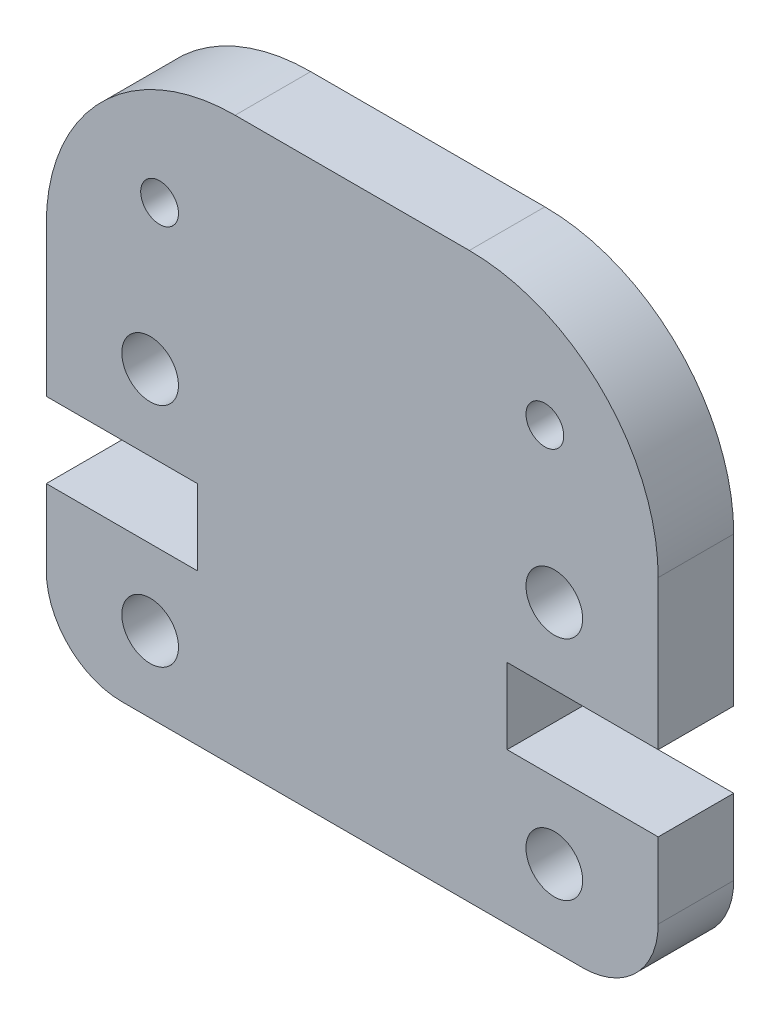
ISO-10303-21;
HEADER;
FILE_DESCRIPTION(('STEP AP214'),'2;1');
FILE_NAME('part.step','',(''),(''),'','','');
FILE_SCHEMA(('AUTOMOTIVE_DESIGN { 1 0 10303 214 1 1 1 1 }'));
ENDSEC;
DATA;
#1=APPLICATION_CONTEXT('core data for automotive mechanical design processes');
#2=APPLICATION_PROTOCOL_DEFINITION('international standard','automotive_design',2000,#1);
#3=PRODUCT_CONTEXT('',#1,'mechanical');
#4=PRODUCT('Part','Part','',(#3));
#5=PRODUCT_RELATED_PRODUCT_CATEGORY('part','',(#4));
#6=PRODUCT_DEFINITION_FORMATION('','',#4);
#7=PRODUCT_DEFINITION_CONTEXT('part definition',#1,'design');
#8=PRODUCT_DEFINITION('design','',#6,#7);
#9=PRODUCT_DEFINITION_SHAPE('','',#8);
#10=(LENGTH_UNIT() NAMED_UNIT(*) SI_UNIT(.MILLI.,.METRE.));
#11=(NAMED_UNIT(*) PLANE_ANGLE_UNIT() SI_UNIT($,.RADIAN.));
#12=(NAMED_UNIT(*) SI_UNIT($,.STERADIAN.) SOLID_ANGLE_UNIT());
#13=UNCERTAINTY_MEASURE_WITH_UNIT(LENGTH_MEASURE(1.E-05),#10,'distance_accuracy_value','');
#14=(GEOMETRIC_REPRESENTATION_CONTEXT(3) GLOBAL_UNCERTAINTY_ASSIGNED_CONTEXT((#13)) GLOBAL_UNIT_ASSIGNED_CONTEXT((#10,
#11,#12)) REPRESENTATION_CONTEXT('',''));
#15=CARTESIAN_POINT('',(0.,0.,0.));
#16=DIRECTION('',(0.,0.,1.));
#17=DIRECTION('',(1.,0.,0.));
#18=AXIS2_PLACEMENT_3D('',#15,#16,#17);
#19=CARTESIAN_POINT('',(14.2,2.,2.));
#20=DIRECTION('',(0.,0.,-1.));
#21=DIRECTION('',(-1.,0.,0.));
#22=AXIS2_PLACEMENT_3D('',#19,#20,#21);
#23=PLANE('',#22);
#24=CARTESIAN_POINT('',(2.75000000000306,2.,2.));
#25=DIRECTION('',(0.,0.,1.));
#26=DIRECTION('',(1.,0.,0.));
#27=AXIS2_PLACEMENT_3D('',#24,#25,#26);
#28=CIRCLE('',#27,0.750000000000133);
#29=CARTESIAN_POINT('',(3.50000000000319,2.,2.));
#30=VERTEX_POINT('',#29);
#31=EDGE_CURVE('E352',#30,#30,#28,.T.);
#32=ORIENTED_EDGE('',*,*,#31,.F.);
#33=EDGE_LOOP('',(#32));
#34=FACE_BOUND('',#33,.T.);
#35=CARTESIAN_POINT('',(13.1999999999968,11.942,2.));
#36=DIRECTION('',(0.,0.,1.));
#37=DIRECTION('',(-1.,0.,0.));
#38=AXIS2_PLACEMENT_3D('',#35,#36,#37);
#39=CIRCLE('',#38,0.499999999999945);
#40=CARTESIAN_POINT('',(12.6999999999968,11.942,2.));
#41=VERTEX_POINT('',#40);
#42=EDGE_CURVE('E364',#41,#41,#39,.T.);
#43=ORIENTED_EDGE('',*,*,#42,.F.);
#44=EDGE_LOOP('',(#43));
#45=FACE_BOUND('',#44,.T.);
#46=CARTESIAN_POINT('',(13.4499999999969,8.,2.));
#47=DIRECTION('',(0.,0.,1.));
#48=DIRECTION('',(1.,0.,0.));
#49=AXIS2_PLACEMENT_3D('',#46,#47,#48);
#50=CIRCLE('',#49,0.750000000003057);
#51=CARTESIAN_POINT('',(14.2,8.,2.));
#52=VERTEX_POINT('',#51);
#53=EDGE_CURVE('E182',#52,#52,#50,.T.);
#54=ORIENTED_EDGE('',*,*,#53,.F.);
#55=EDGE_LOOP('',(#54));
#56=FACE_BOUND('',#55,.T.);
#57=CARTESIAN_POINT('',(14.2,2.,2.));
#58=DIRECTION('',(0.,0.,1.));
#59=DIRECTION('',(-1.,0.,0.));
#60=AXIS2_PLACEMENT_3D('',#57,#58,#59);
#61=CIRCLE('',#60,2.);
#62=CARTESIAN_POINT('',(14.2,0.,2.));
#63=VERTEX_POINT('',#62);
#64=CARTESIAN_POINT('',(16.2,2.,2.));
#65=VERTEX_POINT('',#64);
#66=EDGE_CURVE('E209',#63,#65,#61,.T.);
#67=ORIENTED_EDGE('',*,*,#66,.T.);
#68=DIRECTION('',(0.,1.,0.));
#69=VECTOR('',#68,1.);
#70=CARTESIAN_POINT('',(16.2,2.,2.));
#71=LINE('',#70,#69);
#72=CARTESIAN_POINT('',(16.2,4.,2.));
#73=VERTEX_POINT('',#72);
#74=EDGE_CURVE('E117',#65,#73,#71,.T.);
#75=ORIENTED_EDGE('',*,*,#74,.T.);
#76=DIRECTION('',(-1.,0.,0.));
#77=VECTOR('',#76,1.);
#78=CARTESIAN_POINT('',(12.2,4.,2.));
#79=LINE('',#78,#77);
#80=CARTESIAN_POINT('',(12.2,4.,2.));
#81=VERTEX_POINT('',#80);
#82=EDGE_CURVE('E248',#73,#81,#79,.T.);
#83=ORIENTED_EDGE('',*,*,#82,.T.);
#84=DIRECTION('',(0.,1.,0.));
#85=VECTOR('',#84,1.);
#86=CARTESIAN_POINT('',(12.2,6.,2.));
#87=LINE('',#86,#85);
#88=CARTESIAN_POINT('',(12.2,6.,2.));
#89=VERTEX_POINT('',#88);
#90=EDGE_CURVE('E267',#81,#89,#87,.T.);
#91=ORIENTED_EDGE('',*,*,#90,.T.);
#92=DIRECTION('',(1.,0.,0.));
#93=VECTOR('',#92,1.);
#94=CARTESIAN_POINT('',(16.2,6.00000000000001,2.));
#95=LINE('',#94,#93);
#96=CARTESIAN_POINT('',(16.2,6.00000000000001,2.));
#97=VERTEX_POINT('',#96);
#98=EDGE_CURVE('E264',#89,#97,#95,.T.);
#99=ORIENTED_EDGE('',*,*,#98,.T.);
#100=DIRECTION('',(0.,1.,0.));
#101=VECTOR('',#100,1.);
#102=CARTESIAN_POINT('',(16.2,9.945,2.));
#103=LINE('',#102,#101);
#104=CARTESIAN_POINT('',(16.2,9.945,2.));
#105=VERTEX_POINT('',#104);
#106=EDGE_CURVE('E266',#97,#105,#103,.T.);
#107=ORIENTED_EDGE('',*,*,#106,.T.);
#108=CARTESIAN_POINT('',(11.2,9.94499999999999,2.));
#109=DIRECTION('',(0.,0.,1.));
#110=DIRECTION('',(-1.,0.,0.));
#111=AXIS2_PLACEMENT_3D('',#108,#109,#110);
#112=CIRCLE('',#111,5.);
#113=CARTESIAN_POINT('',(11.2,14.945,2.));
#114=VERTEX_POINT('',#113);
#115=EDGE_CURVE('E269',#105,#114,#112,.T.);
#116=ORIENTED_EDGE('',*,*,#115,.T.);
#117=DIRECTION('',(-1.,0.,0.));
#118=VECTOR('',#117,1.);
#119=CARTESIAN_POINT('',(5.,14.945,2.));
#120=LINE('',#119,#118);
#121=CARTESIAN_POINT('',(5.,14.945,2.));
#122=VERTEX_POINT('',#121);
#123=EDGE_CURVE('E275',#114,#122,#120,.T.);
#124=ORIENTED_EDGE('',*,*,#123,.T.);
#125=CARTESIAN_POINT('',(5.,9.94499999999999,2.));
#126=DIRECTION('',(0.,0.,1.));
#127=DIRECTION('',(1.,0.,0.));
#128=AXIS2_PLACEMENT_3D('',#125,#126,#127);
#129=CIRCLE('',#128,5.);
#130=CARTESIAN_POINT('',(0.,9.94499999999999,2.));
#131=VERTEX_POINT('',#130);
#132=EDGE_CURVE('E277',#122,#131,#129,.T.);
#133=ORIENTED_EDGE('',*,*,#132,.T.);
#134=DIRECTION('',(0.,-1.,0.));
#135=VECTOR('',#134,1.);
#136=CARTESIAN_POINT('',(0.,9.94499999999999,2.));
#137=LINE('',#136,#135);
#138=CARTESIAN_POINT('',(0.,6.00000000000001,2.));
#139=VERTEX_POINT('',#138);
#140=EDGE_CURVE('E279',#131,#139,#137,.T.);
#141=ORIENTED_EDGE('',*,*,#140,.T.);
#142=DIRECTION('',(1.,0.,0.));
#143=VECTOR('',#142,1.);
#144=CARTESIAN_POINT('',(0.,6.00000000000001,2.));
#145=LINE('',#144,#143);
#146=CARTESIAN_POINT('',(4.,6.00000000000001,2.));
#147=VERTEX_POINT('',#146);
#148=EDGE_CURVE('E281',#139,#147,#145,.T.);
#149=ORIENTED_EDGE('',*,*,#148,.T.);
#150=DIRECTION('',(0.,-1.,0.));
#151=VECTOR('',#150,1.);
#152=CARTESIAN_POINT('',(4.,6.00000000000001,2.));
#153=LINE('',#152,#151);
#154=CARTESIAN_POINT('',(4.,4.,2.));
#155=VERTEX_POINT('',#154);
#156=EDGE_CURVE('E283',#147,#155,#153,.T.);
#157=ORIENTED_EDGE('',*,*,#156,.T.);
#158=DIRECTION('',(-1.,0.,0.));
#159=VECTOR('',#158,1.);
#160=CARTESIAN_POINT('',(4.,4.,2.));
#161=LINE('',#160,#159);
#162=CARTESIAN_POINT('',(0.,4.,2.));
#163=VERTEX_POINT('',#162);
#164=EDGE_CURVE('E160',#155,#163,#161,.T.);
#165=ORIENTED_EDGE('',*,*,#164,.T.);
#166=DIRECTION('',(0.,-1.,0.));
#167=VECTOR('',#166,1.);
#168=CARTESIAN_POINT('',(0.,2.,2.));
#169=LINE('',#168,#167);
#170=CARTESIAN_POINT('',(0.,2.,2.));
#171=VERTEX_POINT('',#170);
#172=EDGE_CURVE('E154',#163,#171,#169,.T.);
#173=ORIENTED_EDGE('',*,*,#172,.T.);
#174=CARTESIAN_POINT('',(2.,2.,2.));
#175=DIRECTION('',(0.,0.,1.));
#176=DIRECTION('',(1.,0.,0.));
#177=AXIS2_PLACEMENT_3D('',#174,#175,#176);
#178=CIRCLE('',#177,2.);
#179=CARTESIAN_POINT('',(2.,0.,2.));
#180=VERTEX_POINT('',#179);
#181=EDGE_CURVE('E158',#171,#180,#178,.T.);
#182=ORIENTED_EDGE('',*,*,#181,.T.);
#183=DIRECTION('',(1.,0.,0.));
#184=VECTOR('',#183,1.);
#185=CARTESIAN_POINT('',(2.,0.,2.));
#186=LINE('',#185,#184);
#187=EDGE_CURVE('E50',#180,#63,#186,.T.);
#188=ORIENTED_EDGE('',*,*,#187,.T.);
#189=EDGE_LOOP('',(#67,#75,#83,#91,#99,#107,#116,#124,#133,#141,#149,#157,#165,#173,#182,#188));
#190=FACE_BOUND('',#189,.T.);
#191=CARTESIAN_POINT('',(13.4499999999969,2.,2.));
#192=DIRECTION('',(0.,0.,1.));
#193=DIRECTION('',(-1.,0.,0.));
#194=AXIS2_PLACEMENT_3D('',#191,#192,#193);
#195=CIRCLE('',#194,0.750000000003057);
#196=CARTESIAN_POINT('',(12.6999999999939,2.,2.));
#197=VERTEX_POINT('',#196);
#198=EDGE_CURVE('E370',#197,#197,#195,.T.);
#199=ORIENTED_EDGE('',*,*,#198,.F.);
#200=EDGE_LOOP('',(#199));
#201=FACE_BOUND('',#200,.T.);
#202=CARTESIAN_POINT('',(3.00000000000321,11.942,2.));
#203=DIRECTION('',(0.,0.,1.));
#204=DIRECTION('',(1.,0.,0.));
#205=AXIS2_PLACEMENT_3D('',#202,#203,#204);
#206=CIRCLE('',#205,0.499999999999944);
#207=CARTESIAN_POINT('',(3.50000000000316,11.942,2.));
#208=VERTEX_POINT('',#207);
#209=EDGE_CURVE('E358',#208,#208,#206,.T.);
#210=ORIENTED_EDGE('',*,*,#209,.F.);
#211=EDGE_LOOP('',(#210));
#212=FACE_BOUND('',#211,.T.);
#213=CARTESIAN_POINT('',(2.75000000000306,8.,2.));
#214=DIRECTION('',(0.,0.,1.));
#215=DIRECTION('',(-1.,0.,0.));
#216=AXIS2_PLACEMENT_3D('',#213,#214,#215);
#217=CIRCLE('',#216,0.750000000003058);
#218=CARTESIAN_POINT('',(2.,8.,2.));
#219=VERTEX_POINT('',#218);
#220=EDGE_CURVE('E343',#219,#219,#217,.T.);
#221=ORIENTED_EDGE('',*,*,#220,.F.);
#222=EDGE_LOOP('',(#221));
#223=FACE_BOUND('',#222,.T.);
#224=ADVANCED_FACE('F33',(#34,#45,#56,#190,#201,#212,#223),#23,.F.);
#225=CARTESIAN_POINT('',(14.2,2.,0.));
#226=DIRECTION('',(0.,0.,-1.));
#227=DIRECTION('',(-1.,0.,0.));
#228=AXIS2_PLACEMENT_3D('',#225,#226,#227);
#229=PLANE('',#228);
#230=CARTESIAN_POINT('',(2.75000000000306,2.,0.));
#231=DIRECTION('',(0.,0.,1.));
#232=DIRECTION('',(1.,0.,0.));
#233=AXIS2_PLACEMENT_3D('',#230,#231,#232);
#234=CIRCLE('',#233,0.750000000000133);
#235=CARTESIAN_POINT('',(3.50000000000319,2.,0.));
#236=VERTEX_POINT('',#235);
#237=EDGE_CURVE('E349',#236,#236,#234,.T.);
#238=ORIENTED_EDGE('',*,*,#237,.T.);
#239=EDGE_LOOP('',(#238));
#240=FACE_BOUND('',#239,.T.);
#241=CARTESIAN_POINT('',(13.1999999999968,11.942,0.));
#242=DIRECTION('',(0.,0.,1.));
#243=DIRECTION('',(-1.,0.,0.));
#244=AXIS2_PLACEMENT_3D('',#241,#242,#243);
#245=CIRCLE('',#244,0.499999999999945);
#246=CARTESIAN_POINT('',(12.6999999999968,11.942,0.));
#247=VERTEX_POINT('',#246);
#248=EDGE_CURVE('E361',#247,#247,#245,.T.);
#249=ORIENTED_EDGE('',*,*,#248,.T.);
#250=EDGE_LOOP('',(#249));
#251=FACE_BOUND('',#250,.T.);
#252=CARTESIAN_POINT('',(13.4499999999969,8.,0.));
#253=DIRECTION('',(0.,0.,1.));
#254=DIRECTION('',(1.,0.,0.));
#255=AXIS2_PLACEMENT_3D('',#252,#253,#254);
#256=CIRCLE('',#255,0.750000000003057);
#257=CARTESIAN_POINT('',(14.2,8.,0.));
#258=VERTEX_POINT('',#257);
#259=EDGE_CURVE('E373',#258,#258,#256,.T.);
#260=ORIENTED_EDGE('',*,*,#259,.T.);
#261=EDGE_LOOP('',(#260));
#262=FACE_BOUND('',#261,.T.);
#263=CARTESIAN_POINT('',(14.2,2.,0.));
#264=DIRECTION('',(0.,0.,1.));
#265=DIRECTION('',(-1.,0.,0.));
#266=AXIS2_PLACEMENT_3D('',#263,#264,#265);
#267=CIRCLE('',#266,2.);
#268=CARTESIAN_POINT('',(14.2,0.,0.));
#269=VERTEX_POINT('',#268);
#270=CARTESIAN_POINT('',(16.2,2.,0.));
#271=VERTEX_POINT('',#270);
#272=EDGE_CURVE('E178',#269,#271,#267,.T.);
#273=ORIENTED_EDGE('',*,*,#272,.F.);
#274=DIRECTION('',(1.,0.,0.));
#275=VECTOR('',#274,1.);
#276=CARTESIAN_POINT('',(2.,0.,0.));
#277=LINE('',#276,#275);
#278=CARTESIAN_POINT('',(2.,0.,0.));
#279=VERTEX_POINT('',#278);
#280=EDGE_CURVE('E109',#279,#269,#277,.T.);
#281=ORIENTED_EDGE('',*,*,#280,.F.);
#282=CARTESIAN_POINT('',(2.,2.,0.));
#283=DIRECTION('',(0.,0.,1.));
#284=DIRECTION('',(1.,0.,0.));
#285=AXIS2_PLACEMENT_3D('',#282,#283,#284);
#286=CIRCLE('',#285,2.);
#287=CARTESIAN_POINT('',(0.,2.,0.));
#288=VERTEX_POINT('',#287);
#289=EDGE_CURVE('E103',#288,#279,#286,.T.);
#290=ORIENTED_EDGE('',*,*,#289,.F.);
#291=DIRECTION('',(0.,-1.,0.));
#292=VECTOR('',#291,1.);
#293=CARTESIAN_POINT('',(0.,2.,0.));
#294=LINE('',#293,#292);
#295=CARTESIAN_POINT('',(0.,4.,0.));
#296=VERTEX_POINT('',#295);
#297=EDGE_CURVE('E168',#296,#288,#294,.T.);
#298=ORIENTED_EDGE('',*,*,#297,.F.);
#299=DIRECTION('',(-1.,0.,0.));
#300=VECTOR('',#299,1.);
#301=CARTESIAN_POINT('',(4.,4.,0.));
#302=LINE('',#301,#300);
#303=CARTESIAN_POINT('',(4.,4.,0.));
#304=VERTEX_POINT('',#303);
#305=EDGE_CURVE('E204',#304,#296,#302,.T.);
#306=ORIENTED_EDGE('',*,*,#305,.F.);
#307=DIRECTION('',(0.,-1.,0.));
#308=VECTOR('',#307,1.);
#309=CARTESIAN_POINT('',(4.,6.00000000000001,0.));
#310=LINE('',#309,#308);
#311=CARTESIAN_POINT('',(4.,6.00000000000001,0.));
#312=VERTEX_POINT('',#311);
#313=EDGE_CURVE('E202',#312,#304,#310,.T.);
#314=ORIENTED_EDGE('',*,*,#313,.F.);
#315=DIRECTION('',(1.,0.,0.));
#316=VECTOR('',#315,1.);
#317=CARTESIAN_POINT('',(0.,6.00000000000001,0.));
#318=LINE('',#317,#316);
#319=CARTESIAN_POINT('',(0.,6.00000000000001,0.));
#320=VERTEX_POINT('',#319);
#321=EDGE_CURVE('E200',#320,#312,#318,.T.);
#322=ORIENTED_EDGE('',*,*,#321,.F.);
#323=DIRECTION('',(0.,-1.,0.));
#324=VECTOR('',#323,1.);
#325=CARTESIAN_POINT('',(0.,9.94499999999999,0.));
#326=LINE('',#325,#324);
#327=CARTESIAN_POINT('',(0.,9.94499999999999,0.));
#328=VERTEX_POINT('',#327);
#329=EDGE_CURVE('E198',#328,#320,#326,.T.);
#330=ORIENTED_EDGE('',*,*,#329,.F.);
#331=CARTESIAN_POINT('',(5.,9.94499999999999,0.));
#332=DIRECTION('',(0.,0.,1.));
#333=DIRECTION('',(1.,0.,0.));
#334=AXIS2_PLACEMENT_3D('',#331,#332,#333);
#335=CIRCLE('',#334,5.);
#336=CARTESIAN_POINT('',(5.,14.945,0.));
#337=VERTEX_POINT('',#336);
#338=EDGE_CURVE('E196',#337,#328,#335,.T.);
#339=ORIENTED_EDGE('',*,*,#338,.F.);
#340=DIRECTION('',(-1.,0.,0.));
#341=VECTOR('',#340,1.);
#342=CARTESIAN_POINT('',(5.,14.945,0.));
#343=LINE('',#342,#341);
#344=CARTESIAN_POINT('',(11.2,14.945,0.));
#345=VERTEX_POINT('',#344);
#346=EDGE_CURVE('E194',#345,#337,#343,.T.);
#347=ORIENTED_EDGE('',*,*,#346,.F.);
#348=CARTESIAN_POINT('',(11.2,9.94499999999999,0.));
#349=DIRECTION('',(0.,0.,1.));
#350=DIRECTION('',(-1.,0.,0.));
#351=AXIS2_PLACEMENT_3D('',#348,#349,#350);
#352=CIRCLE('',#351,5.);
#353=CARTESIAN_POINT('',(16.2,9.945,0.));
#354=VERTEX_POINT('',#353);
#355=EDGE_CURVE('E192',#354,#345,#352,.T.);
#356=ORIENTED_EDGE('',*,*,#355,.F.);
#357=DIRECTION('',(0.,1.,0.));
#358=VECTOR('',#357,1.);
#359=CARTESIAN_POINT('',(16.2,9.945,0.));
#360=LINE('',#359,#358);
#361=CARTESIAN_POINT('',(16.2,6.00000000000001,0.));
#362=VERTEX_POINT('',#361);
#363=EDGE_CURVE('E190',#362,#354,#360,.T.);
#364=ORIENTED_EDGE('',*,*,#363,.F.);
#365=DIRECTION('',(1.,0.,0.));
#366=VECTOR('',#365,1.);
#367=CARTESIAN_POINT('',(16.2,6.00000000000001,0.));
#368=LINE('',#367,#366);
#369=CARTESIAN_POINT('',(12.2,6.,0.));
#370=VERTEX_POINT('',#369);
#371=EDGE_CURVE('E188',#370,#362,#368,.T.);
#372=ORIENTED_EDGE('',*,*,#371,.F.);
#373=DIRECTION('',(0.,1.,0.));
#374=VECTOR('',#373,1.);
#375=CARTESIAN_POINT('',(12.2,6.,0.));
#376=LINE('',#375,#374);
#377=CARTESIAN_POINT('',(12.2,4.,0.));
#378=VERTEX_POINT('',#377);
#379=EDGE_CURVE('E186',#378,#370,#376,.T.);
#380=ORIENTED_EDGE('',*,*,#379,.F.);
#381=DIRECTION('',(-1.,0.,0.));
#382=VECTOR('',#381,1.);
#383=CARTESIAN_POINT('',(12.2,4.,0.));
#384=LINE('',#383,#382);
#385=CARTESIAN_POINT('',(16.2,4.,0.));
#386=VERTEX_POINT('',#385);
#387=EDGE_CURVE('E184',#386,#378,#384,.T.);
#388=ORIENTED_EDGE('',*,*,#387,.F.);
#389=DIRECTION('',(0.,1.,0.));
#390=VECTOR('',#389,1.);
#391=CARTESIAN_POINT('',(16.2,2.,0.));
#392=LINE('',#391,#390);
#393=EDGE_CURVE('E181',#271,#386,#392,.T.);
#394=ORIENTED_EDGE('',*,*,#393,.F.);
#395=EDGE_LOOP('',(#273,#281,#290,#298,#306,#314,#322,#330,#339,#347,#356,#364,#372,#380,#388,#394));
#396=FACE_BOUND('',#395,.T.);
#397=CARTESIAN_POINT('',(13.4499999999969,2.,0.));
#398=DIRECTION('',(0.,0.,1.));
#399=DIRECTION('',(-1.,0.,0.));
#400=AXIS2_PLACEMENT_3D('',#397,#398,#399);
#401=CIRCLE('',#400,0.750000000003057);
#402=CARTESIAN_POINT('',(12.6999999999939,2.,0.));
#403=VERTEX_POINT('',#402);
#404=EDGE_CURVE('E367',#403,#403,#401,.T.);
#405=ORIENTED_EDGE('',*,*,#404,.T.);
#406=EDGE_LOOP('',(#405));
#407=FACE_BOUND('',#406,.T.);
#408=CARTESIAN_POINT('',(3.00000000000321,11.942,0.));
#409=DIRECTION('',(0.,0.,1.));
#410=DIRECTION('',(1.,0.,0.));
#411=AXIS2_PLACEMENT_3D('',#408,#409,#410);
#412=CIRCLE('',#411,0.499999999999944);
#413=CARTESIAN_POINT('',(3.50000000000316,11.942,0.));
#414=VERTEX_POINT('',#413);
#415=EDGE_CURVE('E355',#414,#414,#412,.T.);
#416=ORIENTED_EDGE('',*,*,#415,.T.);
#417=EDGE_LOOP('',(#416));
#418=FACE_BOUND('',#417,.T.);
#419=CARTESIAN_POINT('',(2.75000000000306,8.,0.));
#420=DIRECTION('',(0.,0.,1.));
#421=DIRECTION('',(-1.,0.,0.));
#422=AXIS2_PLACEMENT_3D('',#419,#420,#421);
#423=CIRCLE('',#422,0.750000000003058);
#424=CARTESIAN_POINT('',(2.,8.,0.));
#425=VERTEX_POINT('',#424);
#426=EDGE_CURVE('E346',#425,#425,#423,.T.);
#427=ORIENTED_EDGE('',*,*,#426,.T.);
#428=EDGE_LOOP('',(#427));
#429=FACE_BOUND('',#428,.T.);
#430=ADVANCED_FACE('F252',(#240,#251,#262,#396,#407,#418,#429),#229,.T.);
#431=CARTESIAN_POINT('',(14.2,2.,2.));
#432=DIRECTION('',(0.,0.,-1.));
#433=DIRECTION('',(-1.,0.,0.));
#434=AXIS2_PLACEMENT_3D('',#431,#432,#433);
#435=CYLINDRICAL_SURFACE('',#434,2.);
#436=ORIENTED_EDGE('',*,*,#272,.T.);
#437=DIRECTION('',(0.,0.,-1.));
#438=VECTOR('',#437,1.);
#439=CARTESIAN_POINT('',(16.2,2.,2.));
#440=LINE('',#439,#438);
#441=EDGE_CURVE('E11',#65,#271,#440,.T.);
#442=ORIENTED_EDGE('',*,*,#441,.F.);
#443=ORIENTED_EDGE('',*,*,#66,.F.);
#444=DIRECTION('',(0.,0.,-1.));
#445=VECTOR('',#444,1.);
#446=CARTESIAN_POINT('',(14.2,0.,2.));
#447=LINE('',#446,#445);
#448=EDGE_CURVE('E174',#63,#269,#447,.T.);
#449=ORIENTED_EDGE('',*,*,#448,.T.);
#450=EDGE_LOOP('',(#436,#442,#443,#449));
#451=FACE_BOUND('',#450,.T.);
#452=ADVANCED_FACE('F35',(#451),#435,.T.);
#453=CARTESIAN_POINT('',(16.2,2.,2.));
#454=DIRECTION('',(-1.,0.,0.));
#455=DIRECTION('',(0.,0.,1.));
#456=AXIS2_PLACEMENT_3D('',#453,#454,#455);
#457=PLANE('',#456);
#458=ORIENTED_EDGE('',*,*,#393,.T.);
#459=DIRECTION('',(0.,0.,-1.));
#460=VECTOR('',#459,1.);
#461=CARTESIAN_POINT('',(16.2,4.,2.));
#462=LINE('',#461,#460);
#463=EDGE_CURVE('E42',#73,#386,#462,.T.);
#464=ORIENTED_EDGE('',*,*,#463,.F.);
#465=ORIENTED_EDGE('',*,*,#74,.F.);
#466=ORIENTED_EDGE('',*,*,#441,.T.);
#467=EDGE_LOOP('',(#458,#464,#465,#466));
#468=FACE_BOUND('',#467,.T.);
#469=ADVANCED_FACE('F540',(#468),#457,.F.);
#470=CARTESIAN_POINT('',(12.2,4.,2.));
#471=DIRECTION('',(0.,-1.,0.));
#472=DIRECTION('',(1.,0.,0.));
#473=AXIS2_PLACEMENT_3D('',#470,#471,#472);
#474=PLANE('',#473);
#475=ORIENTED_EDGE('',*,*,#387,.T.);
#476=DIRECTION('',(0.,0.,-1.));
#477=VECTOR('',#476,1.);
#478=CARTESIAN_POINT('',(12.2,4.,2.));
#479=LINE('',#478,#477);
#480=EDGE_CURVE('E240',#81,#378,#479,.T.);
#481=ORIENTED_EDGE('',*,*,#480,.F.);
#482=ORIENTED_EDGE('',*,*,#82,.F.);
#483=ORIENTED_EDGE('',*,*,#463,.T.);
#484=EDGE_LOOP('',(#475,#481,#482,#483));
#485=FACE_BOUND('',#484,.T.);
#486=ADVANCED_FACE('F246',(#485),#474,.F.);
#487=CARTESIAN_POINT('',(12.2,6.,2.));
#488=DIRECTION('',(-1.,0.,0.));
#489=DIRECTION('',(0.,0.,1.));
#490=AXIS2_PLACEMENT_3D('',#487,#488,#489);
#491=PLANE('',#490);
#492=ORIENTED_EDGE('',*,*,#379,.T.);
#493=DIRECTION('',(0.,0.,-1.));
#494=VECTOR('',#493,1.);
#495=CARTESIAN_POINT('',(12.2,6.,2.));
#496=LINE('',#495,#494);
#497=EDGE_CURVE('E237',#89,#370,#496,.T.);
#498=ORIENTED_EDGE('',*,*,#497,.F.);
#499=ORIENTED_EDGE('',*,*,#90,.F.);
#500=ORIENTED_EDGE('',*,*,#480,.T.);
#501=EDGE_LOOP('',(#492,#498,#499,#500));
#502=FACE_BOUND('',#501,.T.);
#503=ADVANCED_FACE('F258',(#502),#491,.F.);
#504=CARTESIAN_POINT('',(16.2,6.00000000000001,2.));
#505=DIRECTION('',(0.,1.,0.));
#506=DIRECTION('',(-1.,0.,0.));
#507=AXIS2_PLACEMENT_3D('',#504,#505,#506);
#508=PLANE('',#507);
#509=ORIENTED_EDGE('',*,*,#371,.T.);
#510=DIRECTION('',(0.,0.,-1.));
#511=VECTOR('',#510,1.);
#512=CARTESIAN_POINT('',(16.2,6.00000000000001,2.));
#513=LINE('',#512,#511);
#514=EDGE_CURVE('E234',#97,#362,#513,.T.);
#515=ORIENTED_EDGE('',*,*,#514,.F.);
#516=ORIENTED_EDGE('',*,*,#98,.F.);
#517=ORIENTED_EDGE('',*,*,#497,.T.);
#518=EDGE_LOOP('',(#509,#515,#516,#517));
#519=FACE_BOUND('',#518,.T.);
#520=ADVANCED_FACE('F262',(#519),#508,.F.);
#521=CARTESIAN_POINT('',(16.2,9.945,2.));
#522=DIRECTION('',(-1.,0.,0.));
#523=DIRECTION('',(0.,-1.,0.));
#524=AXIS2_PLACEMENT_3D('',#521,#522,#523);
#525=PLANE('',#524);
#526=ORIENTED_EDGE('',*,*,#363,.T.);
#527=DIRECTION('',(0.,0.,-1.));
#528=VECTOR('',#527,1.);
#529=CARTESIAN_POINT('',(16.2,9.945,2.));
#530=LINE('',#529,#528);
#531=EDGE_CURVE('E231',#105,#354,#530,.T.);
#532=ORIENTED_EDGE('',*,*,#531,.F.);
#533=ORIENTED_EDGE('',*,*,#106,.F.);
#534=ORIENTED_EDGE('',*,*,#514,.T.);
#535=EDGE_LOOP('',(#526,#532,#533,#534));
#536=FACE_BOUND('',#535,.T.);
#537=ADVANCED_FACE('F505',(#536),#525,.F.);
#538=CARTESIAN_POINT('',(11.2,9.94499999999999,2.));
#539=DIRECTION('',(0.,0.,-1.));
#540=DIRECTION('',(-1.,0.,0.));
#541=AXIS2_PLACEMENT_3D('',#538,#539,#540);
#542=CYLINDRICAL_SURFACE('',#541,5.);
#543=ORIENTED_EDGE('',*,*,#355,.T.);
#544=DIRECTION('',(0.,0.,-1.));
#545=VECTOR('',#544,1.);
#546=CARTESIAN_POINT('',(11.2,14.945,2.));
#547=LINE('',#546,#545);
#548=EDGE_CURVE('E228',#114,#345,#547,.T.);
#549=ORIENTED_EDGE('',*,*,#548,.F.);
#550=ORIENTED_EDGE('',*,*,#115,.F.);
#551=ORIENTED_EDGE('',*,*,#531,.T.);
#552=EDGE_LOOP('',(#543,#549,#550,#551));
#553=FACE_BOUND('',#552,.T.);
#554=ADVANCED_FACE('F495',(#553),#542,.T.);
#555=CARTESIAN_POINT('',(5.,14.945,2.));
#556=DIRECTION('',(0.,-1.,0.));
#557=DIRECTION('',(0.,0.,-1.));
#558=AXIS2_PLACEMENT_3D('',#555,#556,#557);
#559=PLANE('',#558);
#560=ORIENTED_EDGE('',*,*,#346,.T.);
#561=DIRECTION('',(0.,0.,-1.));
#562=VECTOR('',#561,1.);
#563=CARTESIAN_POINT('',(5.,14.945,2.));
#564=LINE('',#563,#562);
#565=EDGE_CURVE('E225',#122,#337,#564,.T.);
#566=ORIENTED_EDGE('',*,*,#565,.F.);
#567=ORIENTED_EDGE('',*,*,#123,.F.);
#568=ORIENTED_EDGE('',*,*,#548,.T.);
#569=EDGE_LOOP('',(#560,#566,#567,#568));
#570=FACE_BOUND('',#569,.T.);
#571=ADVANCED_FACE('F485',(#570),#559,.F.);
#572=CARTESIAN_POINT('',(5.,9.94499999999999,2.));
#573=DIRECTION('',(0.,0.,-1.));
#574=DIRECTION('',(-1.,0.,0.));
#575=AXIS2_PLACEMENT_3D('',#572,#573,#574);
#576=CYLINDRICAL_SURFACE('',#575,5.);
#577=ORIENTED_EDGE('',*,*,#338,.T.);
#578=DIRECTION('',(0.,0.,-1.));
#579=VECTOR('',#578,1.);
#580=CARTESIAN_POINT('',(0.,9.94499999999999,2.));
#581=LINE('',#580,#579);
#582=EDGE_CURVE('E222',#131,#328,#581,.T.);
#583=ORIENTED_EDGE('',*,*,#582,.F.);
#584=ORIENTED_EDGE('',*,*,#132,.F.);
#585=ORIENTED_EDGE('',*,*,#565,.T.);
#586=EDGE_LOOP('',(#577,#583,#584,#585));
#587=FACE_BOUND('',#586,.T.);
#588=ADVANCED_FACE('F475',(#587),#576,.T.);
#589=CARTESIAN_POINT('',(0.,9.94499999999999,2.));
#590=DIRECTION('',(1.,0.,0.));
#591=DIRECTION('',(0.,0.,-1.));
#592=AXIS2_PLACEMENT_3D('',#589,#590,#591);
#593=PLANE('',#592);
#594=ORIENTED_EDGE('',*,*,#329,.T.);
#595=DIRECTION('',(0.,0.,-1.));
#596=VECTOR('',#595,1.);
#597=CARTESIAN_POINT('',(0.,6.00000000000001,2.));
#598=LINE('',#597,#596);
#599=EDGE_CURVE('E219',#139,#320,#598,.T.);
#600=ORIENTED_EDGE('',*,*,#599,.F.);
#601=ORIENTED_EDGE('',*,*,#140,.F.);
#602=ORIENTED_EDGE('',*,*,#582,.T.);
#603=EDGE_LOOP('',(#594,#600,#601,#602));
#604=FACE_BOUND('',#603,.T.);
#605=ADVANCED_FACE('F465',(#604),#593,.F.);
#606=CARTESIAN_POINT('',(0.,6.00000000000001,2.));
#607=DIRECTION('',(0.,1.,0.));
#608=DIRECTION('',(0.,0.,1.));
#609=AXIS2_PLACEMENT_3D('',#606,#607,#608);
#610=PLANE('',#609);
#611=ORIENTED_EDGE('',*,*,#321,.T.);
#612=DIRECTION('',(0.,0.,-1.));
#613=VECTOR('',#612,1.);
#614=CARTESIAN_POINT('',(4.,6.00000000000001,2.));
#615=LINE('',#614,#613);
#616=EDGE_CURVE('E216',#147,#312,#615,.T.);
#617=ORIENTED_EDGE('',*,*,#616,.F.);
#618=ORIENTED_EDGE('',*,*,#148,.F.);
#619=ORIENTED_EDGE('',*,*,#599,.T.);
#620=EDGE_LOOP('',(#611,#617,#618,#619));
#621=FACE_BOUND('',#620,.T.);
#622=ADVANCED_FACE('F456',(#621),#610,.F.);
#623=CARTESIAN_POINT('',(4.,6.00000000000001,2.));
#624=DIRECTION('',(1.,0.,0.));
#625=DIRECTION('',(0.,0.,-1.));
#626=AXIS2_PLACEMENT_3D('',#623,#624,#625);
#627=PLANE('',#626);
#628=ORIENTED_EDGE('',*,*,#313,.T.);
#629=DIRECTION('',(0.,0.,-1.));
#630=VECTOR('',#629,1.);
#631=CARTESIAN_POINT('',(4.,4.,2.));
#632=LINE('',#631,#630);
#633=EDGE_CURVE('E213',#155,#304,#632,.T.);
#634=ORIENTED_EDGE('',*,*,#633,.F.);
#635=ORIENTED_EDGE('',*,*,#156,.F.);
#636=ORIENTED_EDGE('',*,*,#616,.T.);
#637=EDGE_LOOP('',(#628,#634,#635,#636));
#638=FACE_BOUND('',#637,.T.);
#639=ADVANCED_FACE('F289',(#638),#627,.F.);
#640=CARTESIAN_POINT('',(4.,4.,2.));
#641=DIRECTION('',(0.,-1.,0.));
#642=DIRECTION('',(0.,0.,-1.));
#643=AXIS2_PLACEMENT_3D('',#640,#641,#642);
#644=PLANE('',#643);
#645=ORIENTED_EDGE('',*,*,#305,.T.);
#646=DIRECTION('',(0.,0.,-1.));
#647=VECTOR('',#646,1.);
#648=CARTESIAN_POINT('',(0.,4.,2.));
#649=LINE('',#648,#647);
#650=EDGE_CURVE('E169',#163,#296,#649,.T.);
#651=ORIENTED_EDGE('',*,*,#650,.F.);
#652=ORIENTED_EDGE('',*,*,#164,.F.);
#653=ORIENTED_EDGE('',*,*,#633,.T.);
#654=EDGE_LOOP('',(#645,#651,#652,#653));
#655=FACE_BOUND('',#654,.T.);
#656=ADVANCED_FACE('F293',(#655),#644,.F.);
#657=CARTESIAN_POINT('',(0.,2.,2.));
#658=DIRECTION('',(1.,0.,0.));
#659=DIRECTION('',(0.,0.,-1.));
#660=AXIS2_PLACEMENT_3D('',#657,#658,#659);
#661=PLANE('',#660);
#662=ORIENTED_EDGE('',*,*,#297,.T.);
#663=DIRECTION('',(0.,0.,-1.));
#664=VECTOR('',#663,1.);
#665=CARTESIAN_POINT('',(0.,2.,2.));
#666=LINE('',#665,#664);
#667=EDGE_CURVE('E165',#171,#288,#666,.T.);
#668=ORIENTED_EDGE('',*,*,#667,.F.);
#669=ORIENTED_EDGE('',*,*,#172,.F.);
#670=ORIENTED_EDGE('',*,*,#650,.T.);
#671=EDGE_LOOP('',(#662,#668,#669,#670));
#672=FACE_BOUND('',#671,.T.);
#673=ADVANCED_FACE('F166',(#672),#661,.F.);
#674=CARTESIAN_POINT('',(2.,2.,2.));
#675=DIRECTION('',(0.,0.,-1.));
#676=DIRECTION('',(-1.,0.,0.));
#677=AXIS2_PLACEMENT_3D('',#674,#675,#676);
#678=CYLINDRICAL_SURFACE('',#677,2.);
#679=ORIENTED_EDGE('',*,*,#289,.T.);
#680=DIRECTION('',(0.,0.,-1.));
#681=VECTOR('',#680,1.);
#682=CARTESIAN_POINT('',(2.,0.,2.));
#683=LINE('',#682,#681);
#684=EDGE_CURVE('E170',#180,#279,#683,.T.);
#685=ORIENTED_EDGE('',*,*,#684,.F.);
#686=ORIENTED_EDGE('',*,*,#181,.F.);
#687=ORIENTED_EDGE('',*,*,#667,.T.);
#688=EDGE_LOOP('',(#679,#685,#686,#687));
#689=FACE_BOUND('',#688,.T.);
#690=ADVANCED_FACE('F172',(#689),#678,.T.);
#691=CARTESIAN_POINT('',(2.,0.,2.));
#692=DIRECTION('',(0.,1.,0.));
#693=DIRECTION('',(-1.,0.,0.));
#694=AXIS2_PLACEMENT_3D('',#691,#692,#693);
#695=PLANE('',#694);
#696=ORIENTED_EDGE('',*,*,#280,.T.);
#697=ORIENTED_EDGE('',*,*,#448,.F.);
#698=ORIENTED_EDGE('',*,*,#187,.F.);
#699=ORIENTED_EDGE('',*,*,#684,.T.);
#700=EDGE_LOOP('',(#696,#697,#698,#699));
#701=FACE_BOUND('',#700,.T.);
#702=ADVANCED_FACE('F297',(#701),#695,.F.);
#703=CARTESIAN_POINT('',(13.4499999999969,8.,2.));
#704=DIRECTION('',(0.,0.,-1.));
#705=DIRECTION('',(-1.,0.,0.));
#706=AXIS2_PLACEMENT_3D('',#703,#704,#705);
#707=CYLINDRICAL_SURFACE('',#706,0.750000000003057);
#708=ORIENTED_EDGE('',*,*,#53,.T.);
#709=EDGE_LOOP('',(#708));
#710=FACE_BOUND('',#709,.T.);
#711=ORIENTED_EDGE('',*,*,#259,.F.);
#712=EDGE_LOOP('',(#711));
#713=FACE_BOUND('',#712,.T.);
#714=ADVANCED_FACE('F299',(#710,#713),#707,.F.);
#715=CARTESIAN_POINT('',(13.4499999999969,2.,2.));
#716=DIRECTION('',(0.,0.,-1.));
#717=DIRECTION('',(-1.,0.,0.));
#718=AXIS2_PLACEMENT_3D('',#715,#716,#717);
#719=CYLINDRICAL_SURFACE('',#718,0.750000000003057);
#720=ORIENTED_EDGE('',*,*,#198,.T.);
#721=EDGE_LOOP('',(#720));
#722=FACE_BOUND('',#721,.T.);
#723=ORIENTED_EDGE('',*,*,#404,.F.);
#724=EDGE_LOOP('',(#723));
#725=FACE_BOUND('',#724,.T.);
#726=ADVANCED_FACE('F305',(#722,#725),#719,.F.);
#727=CARTESIAN_POINT('',(13.1999999999968,11.942,2.));
#728=DIRECTION('',(0.,0.,-1.));
#729=DIRECTION('',(-1.,0.,0.));
#730=AXIS2_PLACEMENT_3D('',#727,#728,#729);
#731=CYLINDRICAL_SURFACE('',#730,0.499999999999945);
#732=ORIENTED_EDGE('',*,*,#42,.T.);
#733=EDGE_LOOP('',(#732));
#734=FACE_BOUND('',#733,.T.);
#735=ORIENTED_EDGE('',*,*,#248,.F.);
#736=EDGE_LOOP('',(#735));
#737=FACE_BOUND('',#736,.T.);
#738=ADVANCED_FACE('F322',(#734,#737),#731,.F.);
#739=CARTESIAN_POINT('',(3.00000000000321,11.942,2.));
#740=DIRECTION('',(0.,0.,-1.));
#741=DIRECTION('',(-1.,0.,0.));
#742=AXIS2_PLACEMENT_3D('',#739,#740,#741);
#743=CYLINDRICAL_SURFACE('',#742,0.499999999999944);
#744=ORIENTED_EDGE('',*,*,#209,.T.);
#745=EDGE_LOOP('',(#744));
#746=FACE_BOUND('',#745,.T.);
#747=ORIENTED_EDGE('',*,*,#415,.F.);
#748=EDGE_LOOP('',(#747));
#749=FACE_BOUND('',#748,.T.);
#750=ADVANCED_FACE('F326',(#746,#749),#743,.F.);
#751=CARTESIAN_POINT('',(2.75000000000306,2.,2.));
#752=DIRECTION('',(0.,0.,-1.));
#753=DIRECTION('',(-1.,0.,0.));
#754=AXIS2_PLACEMENT_3D('',#751,#752,#753);
#755=CYLINDRICAL_SURFACE('',#754,0.750000000000133);
#756=ORIENTED_EDGE('',*,*,#31,.T.);
#757=EDGE_LOOP('',(#756));
#758=FACE_BOUND('',#757,.T.);
#759=ORIENTED_EDGE('',*,*,#237,.F.);
#760=EDGE_LOOP('',(#759));
#761=FACE_BOUND('',#760,.T.);
#762=ADVANCED_FACE('F330',(#758,#761),#755,.F.);
#763=CARTESIAN_POINT('',(2.75000000000306,8.,2.));
#764=DIRECTION('',(0.,0.,-1.));
#765=DIRECTION('',(-1.,0.,0.));
#766=AXIS2_PLACEMENT_3D('',#763,#764,#765);
#767=CYLINDRICAL_SURFACE('',#766,0.750000000003058);
#768=ORIENTED_EDGE('',*,*,#220,.T.);
#769=EDGE_LOOP('',(#768));
#770=FACE_BOUND('',#769,.T.);
#771=ORIENTED_EDGE('',*,*,#426,.F.);
#772=EDGE_LOOP('',(#771));
#773=FACE_BOUND('',#772,.T.);
#774=ADVANCED_FACE('F334',(#770,#773),#767,.F.);
#775=CLOSED_SHELL('',(#224,#430,#452,#469,#486,#503,#520,#537,#554,#571,#588,#605,#622,#639,
#656,#673,#690,#702,#714,#726,#738,#750,#762,#774));
#776=MANIFOLD_SOLID_BREP('B2',#775);
#777=ADVANCED_BREP_SHAPE_REPRESENTATION('',(#18,#776),#14);
#778=SHAPE_DEFINITION_REPRESENTATION(#9,#777);
ENDSEC;
END-ISO-10303-21;
